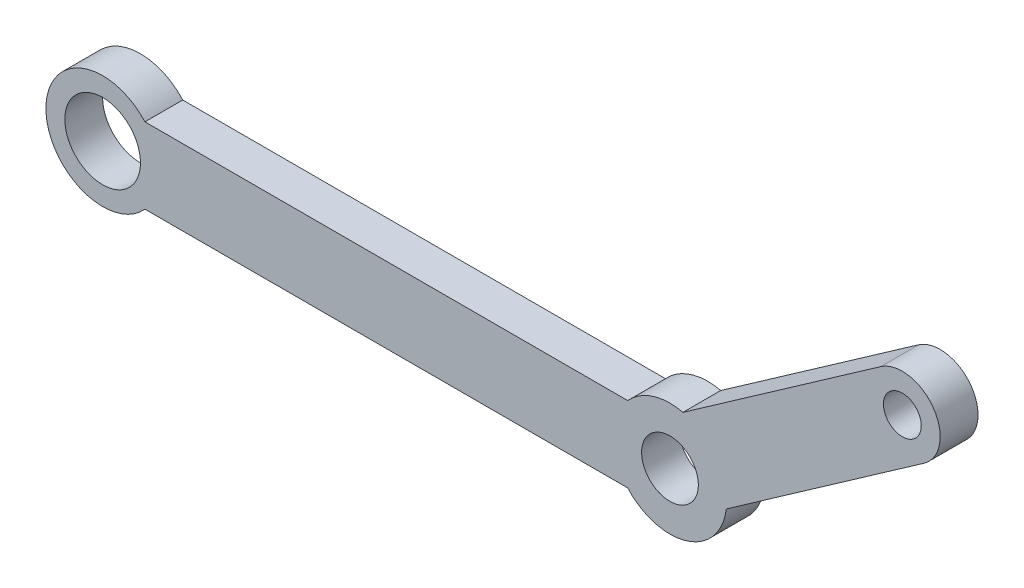
ISO-10303-21;
HEADER;
FILE_DESCRIPTION(('STEP AP214'),'2;1');
FILE_NAME('part.step','',(''),(''),'','','');
FILE_SCHEMA(('AUTOMOTIVE_DESIGN { 1 0 10303 214 1 1 1 1 }'));
ENDSEC;
DATA;
#1=APPLICATION_CONTEXT('core data for automotive mechanical design processes');
#2=APPLICATION_PROTOCOL_DEFINITION('international standard','automotive_design',2000,#1);
#3=PRODUCT_CONTEXT('',#1,'mechanical');
#4=PRODUCT('Part','Part','',(#3));
#5=PRODUCT_RELATED_PRODUCT_CATEGORY('part','',(#4));
#6=PRODUCT_DEFINITION_FORMATION('','',#4);
#7=PRODUCT_DEFINITION_CONTEXT('part definition',#1,'design');
#8=PRODUCT_DEFINITION('design','',#6,#7);
#9=PRODUCT_DEFINITION_SHAPE('','',#8);
#10=(LENGTH_UNIT() NAMED_UNIT(*) SI_UNIT(.MILLI.,.METRE.));
#11=(NAMED_UNIT(*) PLANE_ANGLE_UNIT() SI_UNIT($,.RADIAN.));
#12=(NAMED_UNIT(*) SI_UNIT($,.STERADIAN.) SOLID_ANGLE_UNIT());
#13=UNCERTAINTY_MEASURE_WITH_UNIT(LENGTH_MEASURE(1.E-05),#10,'distance_accuracy_value','');
#14=(GEOMETRIC_REPRESENTATION_CONTEXT(3) GLOBAL_UNCERTAINTY_ASSIGNED_CONTEXT((#13)) GLOBAL_UNIT_ASSIGNED_CONTEXT((#10,
#11,#12)) REPRESENTATION_CONTEXT('',''));
#15=CARTESIAN_POINT('',(0.,0.,0.));
#16=DIRECTION('',(0.,0.,1.));
#17=DIRECTION('',(1.,0.,0.));
#18=AXIS2_PLACEMENT_3D('',#15,#16,#17);
#19=CARTESIAN_POINT('',(30.,0.,-2.));
#20=DIRECTION('',(0.,0.,1.));
#21=DIRECTION('',(-1.,0.,0.));
#22=AXIS2_PLACEMENT_3D('',#19,#20,#21);
#23=CYLINDRICAL_SURFACE('',#22,3.);
#24=CARTESIAN_POINT('',(30.,0.,0.));
#25=DIRECTION('',(0.,0.,1.));
#26=DIRECTION('',(1.,0.,0.));
#27=AXIS2_PLACEMENT_3D('',#24,#25,#26);
#28=CIRCLE('',#27,3.);
#29=CARTESIAN_POINT('',(27.7639320225002,-2.,0.));
#30=VERTEX_POINT('',#29);
#31=CARTESIAN_POINT('',(32.9788325276402,-0.355748186604979,0.));
#32=VERTEX_POINT('',#31);
#33=EDGE_CURVE('E133',#30,#32,#28,.T.);
#34=ORIENTED_EDGE('',*,*,#33,.F.);
#35=DIRECTION('',(0.,0.,1.));
#36=VECTOR('',#35,1.);
#37=CARTESIAN_POINT('',(27.7639320225002,-2.,-2.));
#38=LINE('',#37,#36);
#39=CARTESIAN_POINT('',(27.7639320225002,-2.,-2.));
#40=VERTEX_POINT('',#39);
#41=EDGE_CURVE('E132',#40,#30,#38,.T.);
#42=ORIENTED_EDGE('',*,*,#41,.F.);
#43=CARTESIAN_POINT('',(30.,0.,-2.));
#44=DIRECTION('',(0.,0.,1.));
#45=DIRECTION('',(1.,0.,0.));
#46=AXIS2_PLACEMENT_3D('',#43,#44,#45);
#47=CIRCLE('',#46,3.);
#48=CARTESIAN_POINT('',(32.9788325276402,-0.355748186604979,-2.));
#49=VERTEX_POINT('',#48);
#50=EDGE_CURVE('E152',#40,#49,#47,.T.);
#51=ORIENTED_EDGE('',*,*,#50,.T.);
#52=DIRECTION('',(0.,0.,1.));
#53=VECTOR('',#52,1.);
#54=CARTESIAN_POINT('',(32.9788325276402,-0.355748186604979,-2.));
#55=LINE('',#54,#53);
#56=EDGE_CURVE('E11',#49,#32,#55,.T.);
#57=ORIENTED_EDGE('',*,*,#56,.T.);
#58=EDGE_LOOP('',(#34,#42,#51,#57));
#59=FACE_BOUND('',#58,.T.);
#60=ADVANCED_FACE('F37',(#59),#23,.T.);
#61=CARTESIAN_POINT('',(43.434433537037,6.96534245668763,-2.));
#62=DIRECTION('',(-0.573576436351042,0.819152044288995,0.));
#63=DIRECTION('',(-0.819152044288995,-0.573576436351042,0.));
#64=AXIS2_PLACEMENT_3D('',#61,#62,#63);
#65=PLANE('',#64);
#66=DIRECTION('',(0.819152044288995,0.573576436351042,0.));
#67=VECTOR('',#66,1.);
#68=CARTESIAN_POINT('',(43.434433537037,6.96534245668763,0.));
#69=LINE('',#68,#67);
#70=CARTESIAN_POINT('',(43.434433537037,6.96534245668763,0.));
#71=VERTEX_POINT('',#70);
#72=EDGE_CURVE('E135',#32,#71,#69,.T.);
#73=ORIENTED_EDGE('',*,*,#72,.F.);
#74=ORIENTED_EDGE('',*,*,#56,.F.);
#75=DIRECTION('',(0.819152044288995,0.573576436351042,0.));
#76=VECTOR('',#75,1.);
#77=CARTESIAN_POINT('',(43.434433537037,6.96534245668763,-2.));
#78=LINE('',#77,#76);
#79=CARTESIAN_POINT('',(43.434433537037,6.96534245668763,-2.));
#80=VERTEX_POINT('',#79);
#81=EDGE_CURVE('E91',#49,#80,#78,.T.);
#82=ORIENTED_EDGE('',*,*,#81,.T.);
#83=DIRECTION('',(0.,0.,1.));
#84=VECTOR('',#83,1.);
#85=CARTESIAN_POINT('',(43.434433537037,6.96534245668763,-2.));
#86=LINE('',#85,#84);
#87=EDGE_CURVE('E45',#80,#71,#86,.T.);
#88=ORIENTED_EDGE('',*,*,#87,.T.);
#89=EDGE_LOOP('',(#73,#74,#82,#88));
#90=FACE_BOUND('',#89,.T.);
#91=ADVANCED_FACE('F164',(#90),#65,.F.);
#92=CARTESIAN_POINT('',(42.2872806643349,8.60364654526562,-2.));
#93=DIRECTION('',(0.,0.,1.));
#94=DIRECTION('',(-1.,0.,0.));
#95=AXIS2_PLACEMENT_3D('',#92,#93,#94);
#96=CYLINDRICAL_SURFACE('',#95,2.);
#97=CARTESIAN_POINT('',(42.2872806643349,8.60364654526562,0.));
#98=DIRECTION('',(0.,0.,1.));
#99=DIRECTION('',(1.,0.,0.));
#100=AXIS2_PLACEMENT_3D('',#97,#98,#99);
#101=CIRCLE('',#100,2.);
#102=CARTESIAN_POINT('',(41.1401277916328,10.2419506338436,0.));
#103=VERTEX_POINT('',#102);
#104=EDGE_CURVE('E139',#71,#103,#101,.T.);
#105=ORIENTED_EDGE('',*,*,#104,.F.);
#106=ORIENTED_EDGE('',*,*,#87,.F.);
#107=CARTESIAN_POINT('',(42.2872806643349,8.60364654526562,-2.));
#108=DIRECTION('',(0.,0.,1.));
#109=DIRECTION('',(1.,0.,0.));
#110=AXIS2_PLACEMENT_3D('',#107,#108,#109);
#111=CIRCLE('',#110,2.);
#112=CARTESIAN_POINT('',(41.1401277916328,10.2419506338436,-2.));
#113=VERTEX_POINT('',#112);
#114=EDGE_CURVE('E173',#80,#113,#111,.T.);
#115=ORIENTED_EDGE('',*,*,#114,.T.);
#116=DIRECTION('',(0.,0.,1.));
#117=VECTOR('',#116,1.);
#118=CARTESIAN_POINT('',(41.1401277916328,10.2419506338436,-2.));
#119=LINE('',#118,#117);
#120=EDGE_CURVE('E159',#113,#103,#119,.T.);
#121=ORIENTED_EDGE('',*,*,#120,.T.);
#122=EDGE_LOOP('',(#105,#106,#115,#121));
#123=FACE_BOUND('',#122,.T.);
#124=ADVANCED_FACE('F186',(#123),#96,.T.);
#125=CARTESIAN_POINT('',(41.1401277916328,10.2419506338436,-2.));
#126=DIRECTION('',(0.573576436351041,-0.819152044288995,0.));
#127=DIRECTION('',(0.819152044288995,0.573576436351041,0.));
#128=AXIS2_PLACEMENT_3D('',#125,#126,#127);
#129=PLANE('',#128);
#130=DIRECTION('',(-0.819152044288995,-0.573576436351041,0.));
#131=VECTOR('',#130,1.);
#132=CARTESIAN_POINT('',(41.1401277916328,10.2419506338436,0.));
#133=LINE('',#132,#131);
#134=CARTESIAN_POINT('',(30.684526782236,2.920859990551,0.));
#135=VERTEX_POINT('',#134);
#136=EDGE_CURVE('E142',#103,#135,#133,.T.);
#137=ORIENTED_EDGE('',*,*,#136,.F.);
#138=ORIENTED_EDGE('',*,*,#120,.F.);
#139=DIRECTION('',(-0.819152044288995,-0.573576436351041,0.));
#140=VECTOR('',#139,1.);
#141=CARTESIAN_POINT('',(41.1401277916328,10.2419506338436,-2.));
#142=LINE('',#141,#140);
#143=CARTESIAN_POINT('',(30.684526782236,2.920859990551,-2.));
#144=VERTEX_POINT('',#143);
#145=EDGE_CURVE('E127',#113,#144,#142,.T.);
#146=ORIENTED_EDGE('',*,*,#145,.T.);
#147=DIRECTION('',(0.,0.,1.));
#148=VECTOR('',#147,1.);
#149=CARTESIAN_POINT('',(30.684526782236,2.920859990551,-2.));
#150=LINE('',#149,#148);
#151=EDGE_CURVE('E156',#144,#135,#150,.T.);
#152=ORIENTED_EDGE('',*,*,#151,.T.);
#153=EDGE_LOOP('',(#137,#138,#146,#152));
#154=FACE_BOUND('',#153,.T.);
#155=ADVANCED_FACE('F182',(#154),#129,.F.);
#156=CARTESIAN_POINT('',(30.,0.,-2.));
#157=DIRECTION('',(0.,0.,1.));
#158=DIRECTION('',(-1.,0.,0.));
#159=AXIS2_PLACEMENT_3D('',#156,#157,#158);
#160=CYLINDRICAL_SURFACE('',#159,3.);
#161=CARTESIAN_POINT('',(30.,0.,0.));
#162=DIRECTION('',(0.,0.,1.));
#163=DIRECTION('',(1.,0.,0.));
#164=AXIS2_PLACEMENT_3D('',#161,#162,#163);
#165=CIRCLE('',#164,3.);
#166=CARTESIAN_POINT('',(27.7639320225002,2.,0.));
#167=VERTEX_POINT('',#166);
#168=EDGE_CURVE('E145',#135,#167,#165,.T.);
#169=ORIENTED_EDGE('',*,*,#168,.F.);
#170=ORIENTED_EDGE('',*,*,#151,.F.);
#171=CARTESIAN_POINT('',(30.,0.,-2.));
#172=DIRECTION('',(0.,0.,1.));
#173=DIRECTION('',(1.,0.,0.));
#174=AXIS2_PLACEMENT_3D('',#171,#172,#173);
#175=CIRCLE('',#174,3.);
#176=CARTESIAN_POINT('',(27.7639320225002,2.,-2.));
#177=VERTEX_POINT('',#176);
#178=EDGE_CURVE('E125',#144,#177,#175,.T.);
#179=ORIENTED_EDGE('',*,*,#178,.T.);
#180=DIRECTION('',(0.,0.,1.));
#181=VECTOR('',#180,1.);
#182=CARTESIAN_POINT('',(27.7639320225002,2.,-2.));
#183=LINE('',#182,#181);
#184=EDGE_CURVE('E119',#177,#167,#183,.T.);
#185=ORIENTED_EDGE('',*,*,#184,.T.);
#186=EDGE_LOOP('',(#169,#170,#179,#185));
#187=FACE_BOUND('',#186,.T.);
#188=ADVANCED_FACE('F185',(#187),#160,.T.);
#189=CARTESIAN_POINT('',(2.23606797749979,2.,-2.));
#190=DIRECTION('',(0.,-1.,0.));
#191=DIRECTION('',(0.,0.,1.));
#192=AXIS2_PLACEMENT_3D('',#189,#190,#191);
#193=PLANE('',#192);
#194=DIRECTION('',(-1.,0.,0.));
#195=VECTOR('',#194,1.);
#196=CARTESIAN_POINT('',(2.23606797749979,2.,0.));
#197=LINE('',#196,#195);
#198=CARTESIAN_POINT('',(2.23606797749979,2.,0.));
#199=VERTEX_POINT('',#198);
#200=EDGE_CURVE('E148',#167,#199,#197,.T.);
#201=ORIENTED_EDGE('',*,*,#200,.F.);
#202=ORIENTED_EDGE('',*,*,#184,.F.);
#203=DIRECTION('',(-1.,0.,0.));
#204=VECTOR('',#203,1.);
#205=CARTESIAN_POINT('',(2.23606797749979,2.,-2.));
#206=LINE('',#205,#204);
#207=CARTESIAN_POINT('',(2.23606797749979,2.,-2.));
#208=VERTEX_POINT('',#207);
#209=EDGE_CURVE('E109',#177,#208,#206,.T.);
#210=ORIENTED_EDGE('',*,*,#209,.T.);
#211=DIRECTION('',(0.,0.,1.));
#212=VECTOR('',#211,1.);
#213=CARTESIAN_POINT('',(2.23606797749979,2.,-2.));
#214=LINE('',#213,#212);
#215=EDGE_CURVE('E114',#208,#199,#214,.T.);
#216=ORIENTED_EDGE('',*,*,#215,.T.);
#217=EDGE_LOOP('',(#201,#202,#210,#216));
#218=FACE_BOUND('',#217,.T.);
#219=ADVANCED_FACE('F122',(#218),#193,.F.);
#220=CARTESIAN_POINT('',(0.,0.,-2.));
#221=DIRECTION('',(0.,0.,1.));
#222=DIRECTION('',(-1.,0.,0.));
#223=AXIS2_PLACEMENT_3D('',#220,#221,#222);
#224=CYLINDRICAL_SURFACE('',#223,3.);
#225=CARTESIAN_POINT('',(0.,0.,0.));
#226=DIRECTION('',(0.,0.,1.));
#227=DIRECTION('',(1.,0.,0.));
#228=AXIS2_PLACEMENT_3D('',#225,#226,#227);
#229=CIRCLE('',#228,3.);
#230=CARTESIAN_POINT('',(2.23606797749979,-2.,0.));
#231=VERTEX_POINT('',#230);
#232=EDGE_CURVE('E116',#199,#231,#229,.T.);
#233=ORIENTED_EDGE('',*,*,#232,.F.);
#234=ORIENTED_EDGE('',*,*,#215,.F.);
#235=CARTESIAN_POINT('',(0.,0.,-2.));
#236=DIRECTION('',(0.,0.,1.));
#237=DIRECTION('',(1.,0.,0.));
#238=AXIS2_PLACEMENT_3D('',#235,#236,#237);
#239=CIRCLE('',#238,3.);
#240=CARTESIAN_POINT('',(2.23606797749979,-2.,-2.));
#241=VERTEX_POINT('',#240);
#242=EDGE_CURVE('E105',#208,#241,#239,.T.);
#243=ORIENTED_EDGE('',*,*,#242,.T.);
#244=DIRECTION('',(0.,0.,1.));
#245=VECTOR('',#244,1.);
#246=CARTESIAN_POINT('',(2.23606797749979,-2.,-2.));
#247=LINE('',#246,#245);
#248=EDGE_CURVE('E120',#241,#231,#247,.T.);
#249=ORIENTED_EDGE('',*,*,#248,.T.);
#250=EDGE_LOOP('',(#233,#234,#243,#249));
#251=FACE_BOUND('',#250,.T.);
#252=ADVANCED_FACE('F115',(#251),#224,.T.);
#253=CARTESIAN_POINT('',(2.23606797749979,-2.,-2.));
#254=DIRECTION('',(0.,1.,0.));
#255=DIRECTION('',(0.,0.,-1.));
#256=AXIS2_PLACEMENT_3D('',#253,#254,#255);
#257=PLANE('',#256);
#258=DIRECTION('',(1.,0.,0.));
#259=VECTOR('',#258,1.);
#260=CARTESIAN_POINT('',(2.23606797749979,-2.,0.));
#261=LINE('',#260,#259);
#262=EDGE_CURVE('E79',#231,#30,#261,.T.);
#263=ORIENTED_EDGE('',*,*,#262,.F.);
#264=ORIENTED_EDGE('',*,*,#248,.F.);
#265=DIRECTION('',(1.,0.,0.));
#266=VECTOR('',#265,1.);
#267=CARTESIAN_POINT('',(2.23606797749979,-2.,-2.));
#268=LINE('',#267,#266);
#269=EDGE_CURVE('E53',#241,#40,#268,.T.);
#270=ORIENTED_EDGE('',*,*,#269,.T.);
#271=ORIENTED_EDGE('',*,*,#41,.T.);
#272=EDGE_LOOP('',(#263,#264,#270,#271));
#273=FACE_BOUND('',#272,.T.);
#274=ADVANCED_FACE('F237',(#273),#257,.F.);
#275=CARTESIAN_POINT('',(30.,0.,-2.));
#276=DIRECTION('',(0.,0.,-1.));
#277=DIRECTION('',(1.,0.,0.));
#278=AXIS2_PLACEMENT_3D('',#275,#276,#277);
#279=PLANE('',#278);
#280=CARTESIAN_POINT('',(30.,0.,-2.));
#281=DIRECTION('',(0.,0.,1.));
#282=DIRECTION('',(1.,0.,0.));
#283=AXIS2_PLACEMENT_3D('',#280,#281,#282);
#284=CIRCLE('',#283,1.5);
#285=CARTESIAN_POINT('',(31.5,0.,-2.));
#286=VERTEX_POINT('',#285);
#287=EDGE_CURVE('E302',#286,#286,#284,.T.);
#288=ORIENTED_EDGE('',*,*,#287,.T.);
#289=EDGE_LOOP('',(#288));
#290=FACE_BOUND('',#289,.T.);
#291=CARTESIAN_POINT('',(42.2872806643349,8.60364654526562,-2.));
#292=DIRECTION('',(0.,0.,1.));
#293=DIRECTION('',(1.,0.,0.));
#294=AXIS2_PLACEMENT_3D('',#291,#292,#293);
#295=CIRCLE('',#294,0.999999999999998);
#296=CARTESIAN_POINT('',(43.2872806643349,8.60364654526562,-2.));
#297=VERTEX_POINT('',#296);
#298=EDGE_CURVE('E307',#297,#297,#295,.T.);
#299=ORIENTED_EDGE('',*,*,#298,.T.);
#300=EDGE_LOOP('',(#299));
#301=FACE_BOUND('',#300,.T.);
#302=CARTESIAN_POINT('',(0.,0.,-2.));
#303=DIRECTION('',(0.,0.,1.));
#304=DIRECTION('',(1.,0.,0.));
#305=AXIS2_PLACEMENT_3D('',#302,#303,#304);
#306=CIRCLE('',#305,2.);
#307=CARTESIAN_POINT('',(2.,0.,-2.));
#308=VERTEX_POINT('',#307);
#309=EDGE_CURVE('E176',#308,#308,#306,.T.);
#310=ORIENTED_EDGE('',*,*,#309,.T.);
#311=EDGE_LOOP('',(#310));
#312=FACE_BOUND('',#311,.T.);
#313=ORIENTED_EDGE('',*,*,#50,.F.);
#314=ORIENTED_EDGE('',*,*,#269,.F.);
#315=ORIENTED_EDGE('',*,*,#242,.F.);
#316=ORIENTED_EDGE('',*,*,#209,.F.);
#317=ORIENTED_EDGE('',*,*,#178,.F.);
#318=ORIENTED_EDGE('',*,*,#145,.F.);
#319=ORIENTED_EDGE('',*,*,#114,.F.);
#320=ORIENTED_EDGE('',*,*,#81,.F.);
#321=EDGE_LOOP('',(#313,#314,#315,#316,#317,#318,#319,#320));
#322=FACE_BOUND('',#321,.T.);
#323=ADVANCED_FACE('F107',(#290,#301,#312,#322),#279,.T.);
#324=CARTESIAN_POINT('',(30.,0.,0.));
#325=DIRECTION('',(0.,0.,-1.));
#326=DIRECTION('',(1.,0.,0.));
#327=AXIS2_PLACEMENT_3D('',#324,#325,#326);
#328=PLANE('',#327);
#329=CARTESIAN_POINT('',(30.,0.,0.));
#330=DIRECTION('',(0.,0.,1.));
#331=DIRECTION('',(1.,0.,0.));
#332=AXIS2_PLACEMENT_3D('',#329,#330,#331);
#333=CIRCLE('',#332,1.5);
#334=CARTESIAN_POINT('',(31.5,0.,0.));
#335=VERTEX_POINT('',#334);
#336=EDGE_CURVE('E299',#335,#335,#333,.T.);
#337=ORIENTED_EDGE('',*,*,#336,.F.);
#338=EDGE_LOOP('',(#337));
#339=FACE_BOUND('',#338,.T.);
#340=CARTESIAN_POINT('',(42.2872806643349,8.60364654526562,0.));
#341=DIRECTION('',(0.,0.,1.));
#342=DIRECTION('',(1.,0.,0.));
#343=AXIS2_PLACEMENT_3D('',#340,#341,#342);
#344=CIRCLE('',#343,0.999999999999998);
#345=CARTESIAN_POINT('',(43.2872806643349,8.60364654526562,0.));
#346=VERTEX_POINT('',#345);
#347=EDGE_CURVE('E303',#346,#346,#344,.T.);
#348=ORIENTED_EDGE('',*,*,#347,.F.);
#349=EDGE_LOOP('',(#348));
#350=FACE_BOUND('',#349,.T.);
#351=CARTESIAN_POINT('',(0.,0.,0.));
#352=DIRECTION('',(0.,0.,1.));
#353=DIRECTION('',(1.,0.,0.));
#354=AXIS2_PLACEMENT_3D('',#351,#352,#353);
#355=CIRCLE('',#354,2.);
#356=CARTESIAN_POINT('',(2.,0.,0.));
#357=VERTEX_POINT('',#356);
#358=EDGE_CURVE('E136',#357,#357,#355,.T.);
#359=ORIENTED_EDGE('',*,*,#358,.F.);
#360=EDGE_LOOP('',(#359));
#361=FACE_BOUND('',#360,.T.);
#362=ORIENTED_EDGE('',*,*,#33,.T.);
#363=ORIENTED_EDGE('',*,*,#72,.T.);
#364=ORIENTED_EDGE('',*,*,#104,.T.);
#365=ORIENTED_EDGE('',*,*,#136,.T.);
#366=ORIENTED_EDGE('',*,*,#168,.T.);
#367=ORIENTED_EDGE('',*,*,#200,.T.);
#368=ORIENTED_EDGE('',*,*,#232,.T.);
#369=ORIENTED_EDGE('',*,*,#262,.T.);
#370=EDGE_LOOP('',(#362,#363,#364,#365,#366,#367,#368,#369));
#371=FACE_BOUND('',#370,.T.);
#372=ADVANCED_FACE('F167',(#339,#350,#361,#371),#328,.F.);
#373=CARTESIAN_POINT('',(0.,0.,0.));
#374=DIRECTION('',(0.,0.,-1.));
#375=DIRECTION('',(1.,0.,0.));
#376=AXIS2_PLACEMENT_3D('',#373,#374,#375);
#377=CYLINDRICAL_SURFACE('',#376,2.);
#378=ORIENTED_EDGE('',*,*,#358,.T.);
#379=EDGE_LOOP('',(#378));
#380=FACE_BOUND('',#379,.T.);
#381=ORIENTED_EDGE('',*,*,#309,.F.);
#382=EDGE_LOOP('',(#381));
#383=FACE_BOUND('',#382,.T.);
#384=ADVANCED_FACE('F264',(#380,#383),#377,.F.);
#385=CARTESIAN_POINT('',(42.2872806643349,8.60364654526562,0.));
#386=DIRECTION('',(0.,0.,-1.));
#387=DIRECTION('',(1.,0.,0.));
#388=AXIS2_PLACEMENT_3D('',#385,#386,#387);
#389=CYLINDRICAL_SURFACE('',#388,0.999999999999998);
#390=ORIENTED_EDGE('',*,*,#347,.T.);
#391=EDGE_LOOP('',(#390));
#392=FACE_BOUND('',#391,.T.);
#393=ORIENTED_EDGE('',*,*,#298,.F.);
#394=EDGE_LOOP('',(#393));
#395=FACE_BOUND('',#394,.T.);
#396=ADVANCED_FACE('F274',(#392,#395),#389,.F.);
#397=CARTESIAN_POINT('',(30.,0.,0.));
#398=DIRECTION('',(0.,0.,-1.));
#399=DIRECTION('',(1.,0.,0.));
#400=AXIS2_PLACEMENT_3D('',#397,#398,#399);
#401=CYLINDRICAL_SURFACE('',#400,1.5);
#402=ORIENTED_EDGE('',*,*,#336,.T.);
#403=EDGE_LOOP('',(#402));
#404=FACE_BOUND('',#403,.T.);
#405=ORIENTED_EDGE('',*,*,#287,.F.);
#406=EDGE_LOOP('',(#405));
#407=FACE_BOUND('',#406,.T.);
#408=ADVANCED_FACE('F283',(#404,#407),#401,.F.);
#409=CLOSED_SHELL('',(#60,#91,#124,#155,#188,#219,#252,#274,#323,#372,#384,#396,#408));
#410=MANIFOLD_SOLID_BREP('B2',#409);
#411=ADVANCED_BREP_SHAPE_REPRESENTATION('',(#18,#410),#14);
#412=SHAPE_DEFINITION_REPRESENTATION(#9,#411);
ENDSEC;
END-ISO-10303-21;
